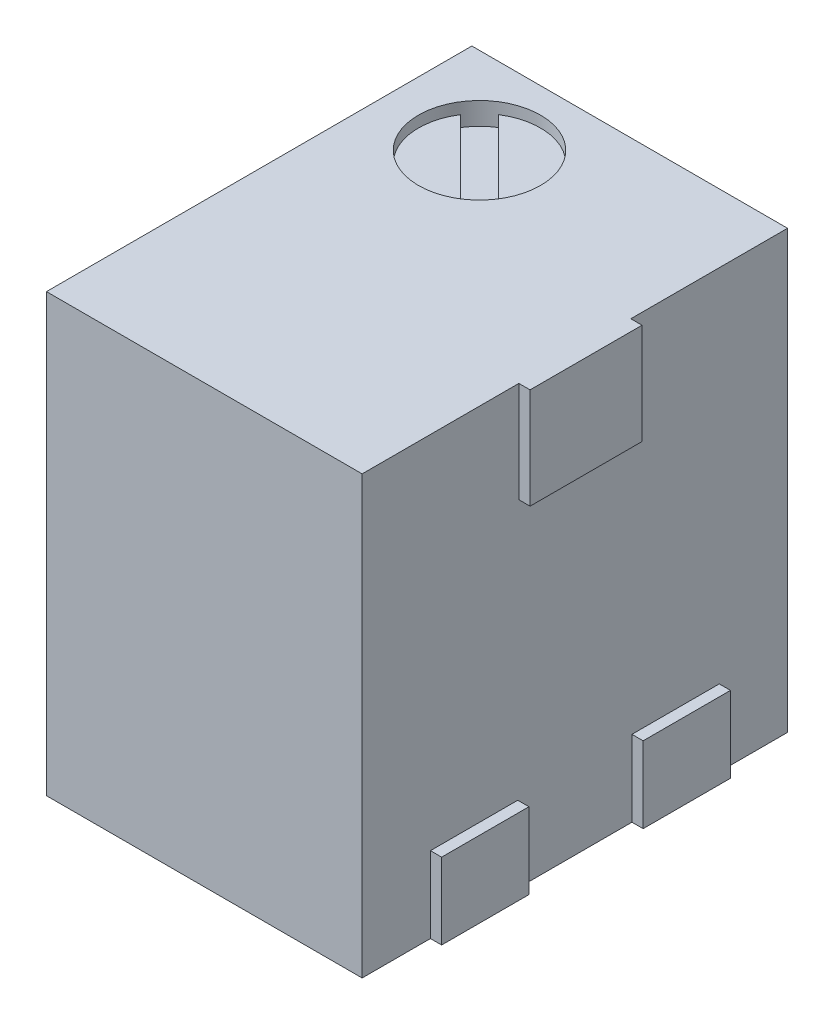
ISO-10303-21;
HEADER;
FILE_DESCRIPTION(('STEP AP214'),'2;1');
FILE_NAME('part.step','',(''),(''),'','','');
FILE_SCHEMA(('AUTOMOTIVE_DESIGN { 1 0 10303 214 1 1 1 1 }'));
ENDSEC;
DATA;
#1=APPLICATION_CONTEXT('core data for automotive mechanical design processes');
#2=APPLICATION_PROTOCOL_DEFINITION('international standard','automotive_design',2000,#1);
#3=PRODUCT_CONTEXT('',#1,'mechanical');
#4=PRODUCT('Part','Part','',(#3));
#5=PRODUCT_RELATED_PRODUCT_CATEGORY('part','',(#4));
#6=PRODUCT_DEFINITION_FORMATION('','',#4);
#7=PRODUCT_DEFINITION_CONTEXT('part definition',#1,'design');
#8=PRODUCT_DEFINITION('design','',#6,#7);
#9=PRODUCT_DEFINITION_SHAPE('','',#8);
#10=(LENGTH_UNIT() NAMED_UNIT(*) SI_UNIT(.MILLI.,.METRE.));
#11=(NAMED_UNIT(*) PLANE_ANGLE_UNIT() SI_UNIT($,.RADIAN.));
#12=(NAMED_UNIT(*) SI_UNIT($,.STERADIAN.) SOLID_ANGLE_UNIT());
#13=UNCERTAINTY_MEASURE_WITH_UNIT(LENGTH_MEASURE(1.E-05),#10,'distance_accuracy_value','');
#14=(GEOMETRIC_REPRESENTATION_CONTEXT(3) GLOBAL_UNCERTAINTY_ASSIGNED_CONTEXT((#13)) GLOBAL_UNIT_ASSIGNED_CONTEXT((#10,
#11,#12)) REPRESENTATION_CONTEXT('',''));
#15=CARTESIAN_POINT('',(0.,0.,0.));
#16=DIRECTION('',(0.,0.,1.));
#17=DIRECTION('',(1.,0.,0.));
#18=AXIS2_PLACEMENT_3D('',#15,#16,#17);
#19=CARTESIAN_POINT('',(32.6016,0.913499999999793,103.5585));
#20=DIRECTION('',(-1.,0.,0.));
#21=DIRECTION('',(0.,0.,1.));
#22=AXIS2_PLACEMENT_3D('',#19,#20,#21);
#23=PLANE('',#22);
#24=DIRECTION('',(0.,0.,1.));
#25=VECTOR('',#24,1.);
#26=CARTESIAN_POINT('',(32.6016,-1.56300000000021,103.5585));
#27=LINE('',#26,#25);
#28=CARTESIAN_POINT('',(32.6016,-1.56300000000021,101.1455));
#29=VERTEX_POINT('',#28);
#30=CARTESIAN_POINT('',(32.6016,-1.56300000000021,105.9715));
#31=VERTEX_POINT('',#30);
#32=EDGE_CURVE('E11',#29,#31,#27,.T.);
#33=ORIENTED_EDGE('',*,*,#32,.T.);
#34=DIRECTION('',(0.,1.,0.));
#35=VECTOR('',#34,1.);
#36=CARTESIAN_POINT('',(32.6016,0.913499999999793,105.9715));
#37=LINE('',#36,#35);
#38=CARTESIAN_POINT('',(32.6016,3.38999999999979,105.9715));
#39=VERTEX_POINT('',#38);
#40=EDGE_CURVE('E27',#31,#39,#37,.T.);
#41=ORIENTED_EDGE('',*,*,#40,.T.);
#42=DIRECTION('',(0.,0.,-1.));
#43=VECTOR('',#42,1.);
#44=CARTESIAN_POINT('',(32.6016,3.38999999999979,103.5585));
#45=LINE('',#44,#43);
#46=CARTESIAN_POINT('',(32.6016,3.38999999999979,101.1455));
#47=VERTEX_POINT('',#46);
#48=EDGE_CURVE('E244',#39,#47,#45,.T.);
#49=ORIENTED_EDGE('',*,*,#48,.T.);
#50=DIRECTION('',(0.,-1.,0.));
#51=VECTOR('',#50,1.);
#52=CARTESIAN_POINT('',(32.6016,0.913499999999797,101.1455));
#53=LINE('',#52,#51);
#54=EDGE_CURVE('E254',#47,#29,#53,.T.);
#55=ORIENTED_EDGE('',*,*,#54,.T.);
#56=EDGE_LOOP('',(#33,#41,#49,#55));
#57=FACE_BOUND('',#56,.T.);
#58=ADVANCED_FACE('F17',(#57),#23,.T.);
#59=CARTESIAN_POINT('',(36.31,3.38999999999979,105.9715));
#60=DIRECTION('',(0.,0.,1.));
#61=DIRECTION('',(0.,-1.,0.));
#62=AXIS2_PLACEMENT_3D('',#59,#60,#61);
#63=PLANE('',#62);
#64=DIRECTION('',(0.,1.,0.));
#65=VECTOR('',#64,1.);
#66=CARTESIAN_POINT('',(36.183,3.38999999999979,105.9715));
#67=LINE('',#66,#65);
#68=CARTESIAN_POINT('',(36.183,-1.56300000000021,105.9715));
#69=VERTEX_POINT('',#68);
#70=CARTESIAN_POINT('',(36.183,3.38999999999979,105.9715));
#71=VERTEX_POINT('',#70);
#72=EDGE_CURVE('E223',#69,#71,#67,.T.);
#73=ORIENTED_EDGE('',*,*,#72,.T.);
#74=DIRECTION('',(-1.,0.,0.));
#75=VECTOR('',#74,1.);
#76=CARTESIAN_POINT('',(36.31,3.38999999999979,105.9715));
#77=LINE('',#76,#75);
#78=EDGE_CURVE('E212',#71,#39,#77,.T.);
#79=ORIENTED_EDGE('',*,*,#78,.T.);
#80=ORIENTED_EDGE('',*,*,#40,.F.);
#81=DIRECTION('',(1.,0.,0.));
#82=VECTOR('',#81,1.);
#83=CARTESIAN_POINT('',(36.31,-1.56300000000021,105.9715));
#84=LINE('',#83,#82);
#85=EDGE_CURVE('E210',#31,#69,#84,.T.);
#86=ORIENTED_EDGE('',*,*,#85,.T.);
#87=EDGE_LOOP('',(#73,#79,#80,#86));
#88=FACE_BOUND('',#87,.T.);
#89=ADVANCED_FACE('F362',(#88),#63,.T.);
#90=CARTESIAN_POINT('',(36.31,-1.56300000000021,105.9715));
#91=DIRECTION('',(0.,-1.,0.));
#92=DIRECTION('',(0.,0.,-1.));
#93=AXIS2_PLACEMENT_3D('',#90,#91,#92);
#94=PLANE('',#93);
#95=DIRECTION('',(0.,0.,1.));
#96=VECTOR('',#95,1.);
#97=CARTESIAN_POINT('',(36.183,-1.56300000000021,105.9715));
#98=LINE('',#97,#96);
#99=CARTESIAN_POINT('',(36.183,-1.56300000000021,105.1968));
#100=VERTEX_POINT('',#99);
#101=EDGE_CURVE('E202',#100,#69,#98,.T.);
#102=ORIENTED_EDGE('',*,*,#101,.T.);
#103=ORIENTED_EDGE('',*,*,#85,.F.);
#104=ORIENTED_EDGE('',*,*,#32,.F.);
#105=DIRECTION('',(1.,0.,0.));
#106=VECTOR('',#105,1.);
#107=CARTESIAN_POINT('',(36.31,-1.56300000000021,101.1455));
#108=LINE('',#107,#106);
#109=CARTESIAN_POINT('',(36.183,-1.56300000000021,101.1455));
#110=VERTEX_POINT('',#109);
#111=EDGE_CURVE('E199',#29,#110,#108,.T.);
#112=ORIENTED_EDGE('',*,*,#111,.T.);
#113=DIRECTION('',(0.,0.,1.));
#114=VECTOR('',#113,1.);
#115=CARTESIAN_POINT('',(36.183,-1.56300000000021,105.9715));
#116=LINE('',#115,#114);
#117=CARTESIAN_POINT('',(36.183,-1.56300000000021,101.9202));
#118=VERTEX_POINT('',#117);
#119=EDGE_CURVE('E203',#110,#118,#116,.T.);
#120=ORIENTED_EDGE('',*,*,#119,.T.);
#121=DIRECTION('',(1.,0.,0.));
#122=VECTOR('',#121,1.);
#123=CARTESIAN_POINT('',(36.31,-1.56300000000021,101.9202));
#124=LINE('',#123,#122);
#125=CARTESIAN_POINT('',(36.31,-1.56300000000021,101.9202));
#126=VERTEX_POINT('',#125);
#127=EDGE_CURVE('E156',#118,#126,#124,.T.);
#128=ORIENTED_EDGE('',*,*,#127,.T.);
#129=DIRECTION('',(0.,0.,1.));
#130=VECTOR('',#129,1.);
#131=CARTESIAN_POINT('',(36.31,-1.56300000000021,105.9715));
#132=LINE('',#131,#130);
#133=CARTESIAN_POINT('',(36.31,-1.56300000000021,102.9108));
#134=VERTEX_POINT('',#133);
#135=EDGE_CURVE('E183',#126,#134,#132,.T.);
#136=ORIENTED_EDGE('',*,*,#135,.T.);
#137=DIRECTION('',(-1.,0.,0.));
#138=VECTOR('',#137,1.);
#139=CARTESIAN_POINT('',(36.31,-1.56300000000021,102.9108));
#140=LINE('',#139,#138);
#141=CARTESIAN_POINT('',(36.183,-1.56300000000021,102.9108));
#142=VERTEX_POINT('',#141);
#143=EDGE_CURVE('E180',#134,#142,#140,.T.);
#144=ORIENTED_EDGE('',*,*,#143,.T.);
#145=DIRECTION('',(0.,0.,1.));
#146=VECTOR('',#145,1.);
#147=CARTESIAN_POINT('',(36.183,-1.56300000000021,105.9715));
#148=LINE('',#147,#146);
#149=CARTESIAN_POINT('',(36.183,-1.56300000000021,104.2062));
#150=VERTEX_POINT('',#149);
#151=EDGE_CURVE('E178',#142,#150,#148,.T.);
#152=ORIENTED_EDGE('',*,*,#151,.T.);
#153=DIRECTION('',(1.,0.,0.));
#154=VECTOR('',#153,1.);
#155=CARTESIAN_POINT('',(36.31,-1.56300000000021,104.2062));
#156=LINE('',#155,#154);
#157=CARTESIAN_POINT('',(36.31,-1.56300000000021,104.2062));
#158=VERTEX_POINT('',#157);
#159=EDGE_CURVE('E175',#150,#158,#156,.T.);
#160=ORIENTED_EDGE('',*,*,#159,.T.);
#161=DIRECTION('',(0.,0.,1.));
#162=VECTOR('',#161,1.);
#163=CARTESIAN_POINT('',(36.31,-1.56300000000021,105.9715));
#164=LINE('',#163,#162);
#165=CARTESIAN_POINT('',(36.31,-1.56300000000021,105.1968));
#166=VERTEX_POINT('',#165);
#167=EDGE_CURVE('E179',#158,#166,#164,.T.);
#168=ORIENTED_EDGE('',*,*,#167,.T.);
#169=DIRECTION('',(-1.,0.,0.));
#170=VECTOR('',#169,1.);
#171=CARTESIAN_POINT('',(36.31,-1.56300000000021,105.1968));
#172=LINE('',#171,#170);
#173=EDGE_CURVE('E338',#166,#100,#172,.T.);
#174=ORIENTED_EDGE('',*,*,#173,.T.);
#175=EDGE_LOOP('',(#102,#103,#104,#112,#120,#128,#136,#144,#152,#160,#168,#174));
#176=FACE_BOUND('',#175,.T.);
#177=ADVANCED_FACE('F340',(#176),#94,.T.);
#178=CARTESIAN_POINT('',(36.31,-1.5630000000002,101.1455));
#179=DIRECTION('',(0.,0.,-1.));
#180=DIRECTION('',(-1.,0.,0.));
#181=AXIS2_PLACEMENT_3D('',#178,#179,#180);
#182=PLANE('',#181);
#183=DIRECTION('',(0.,-1.,0.));
#184=VECTOR('',#183,1.);
#185=CARTESIAN_POINT('',(36.183,-1.5630000000002,101.1455));
#186=LINE('',#185,#184);
#187=CARTESIAN_POINT('',(36.183,3.38999999999979,101.1455));
#188=VERTEX_POINT('',#187);
#189=EDGE_CURVE('E348',#188,#110,#186,.T.);
#190=ORIENTED_EDGE('',*,*,#189,.T.);
#191=ORIENTED_EDGE('',*,*,#111,.F.);
#192=ORIENTED_EDGE('',*,*,#54,.F.);
#193=DIRECTION('',(1.,0.,0.));
#194=VECTOR('',#193,1.);
#195=CARTESIAN_POINT('',(36.31,3.38999999999979,101.1455));
#196=LINE('',#195,#194);
#197=EDGE_CURVE('E165',#47,#188,#196,.T.);
#198=ORIENTED_EDGE('',*,*,#197,.T.);
#199=EDGE_LOOP('',(#190,#191,#192,#198));
#200=FACE_BOUND('',#199,.T.);
#201=ADVANCED_FACE('F357',(#200),#182,.T.);
#202=CARTESIAN_POINT('',(36.31,3.38999999999979,101.1455));
#203=DIRECTION('',(0.,1.,0.));
#204=DIRECTION('',(0.,0.,1.));
#205=AXIS2_PLACEMENT_3D('',#202,#203,#204);
#206=PLANE('',#205);
#207=CARTESIAN_POINT('',(33.6695990721049,3.38999999999979,102.126748828183));
#208=DIRECTION('',(0.,-1.,0.));
#209=DIRECTION('',(1.,0.,0.));
#210=AXIS2_PLACEMENT_3D('',#207,#208,#209);
#211=CIRCLE('',#210,0.692158872138563);
#212=CARTESIAN_POINT('',(34.3617579442435,3.38999999999979,102.126748828183));
#213=VERTEX_POINT('',#212);
#214=EDGE_CURVE('E173',#213,#213,#211,.T.);
#215=ORIENTED_EDGE('',*,*,#214,.T.);
#216=EDGE_LOOP('',(#215));
#217=FACE_BOUND('',#216,.T.);
#218=DIRECTION('',(0.,0.,-1.));
#219=VECTOR('',#218,1.);
#220=CARTESIAN_POINT('',(36.183,3.38999999999979,101.1455));
#221=LINE('',#220,#219);
#222=CARTESIAN_POINT('',(36.183,3.38999999999979,104.1935));
#223=VERTEX_POINT('',#222);
#224=EDGE_CURVE('E170',#71,#223,#221,.T.);
#225=ORIENTED_EDGE('',*,*,#224,.T.);
#226=DIRECTION('',(1.,0.,0.));
#227=VECTOR('',#226,1.);
#228=CARTESIAN_POINT('',(36.31,3.38999999999979,104.1935));
#229=LINE('',#228,#227);
#230=CARTESIAN_POINT('',(36.31,3.38999999999979,104.1935));
#231=VERTEX_POINT('',#230);
#232=EDGE_CURVE('E174',#223,#231,#229,.T.);
#233=ORIENTED_EDGE('',*,*,#232,.T.);
#234=DIRECTION('',(0.,0.,-1.));
#235=VECTOR('',#234,1.);
#236=CARTESIAN_POINT('',(36.31,3.38999999999979,101.1455));
#237=LINE('',#236,#235);
#238=CARTESIAN_POINT('',(36.31,3.38999999999979,102.9235));
#239=VERTEX_POINT('',#238);
#240=EDGE_CURVE('E217',#231,#239,#237,.T.);
#241=ORIENTED_EDGE('',*,*,#240,.T.);
#242=DIRECTION('',(-1.,0.,0.));
#243=VECTOR('',#242,1.);
#244=CARTESIAN_POINT('',(36.31,3.38999999999979,102.9235));
#245=LINE('',#244,#243);
#246=CARTESIAN_POINT('',(36.183,3.38999999999979,102.9235));
#247=VERTEX_POINT('',#246);
#248=EDGE_CURVE('E220',#239,#247,#245,.T.);
#249=ORIENTED_EDGE('',*,*,#248,.T.);
#250=DIRECTION('',(0.,0.,-1.));
#251=VECTOR('',#250,1.);
#252=CARTESIAN_POINT('',(36.183,3.38999999999979,101.1455));
#253=LINE('',#252,#251);
#254=EDGE_CURVE('E225',#247,#188,#253,.T.);
#255=ORIENTED_EDGE('',*,*,#254,.T.);
#256=ORIENTED_EDGE('',*,*,#197,.F.);
#257=ORIENTED_EDGE('',*,*,#48,.F.);
#258=ORIENTED_EDGE('',*,*,#78,.F.);
#259=EDGE_LOOP('',(#225,#233,#241,#249,#255,#256,#257,#258));
#260=FACE_BOUND('',#259,.T.);
#261=ADVANCED_FACE('F358',(#217,#260),#206,.T.);
#262=CARTESIAN_POINT('',(36.183,0.680918984547255,103.5585));
#263=DIRECTION('',(1.,0.,0.));
#264=DIRECTION('',(0.,0.,-1.));
#265=AXIS2_PLACEMENT_3D('',#262,#263,#264);
#266=PLANE('',#265);
#267=ORIENTED_EDGE('',*,*,#189,.F.);
#268=ORIENTED_EDGE('',*,*,#254,.F.);
#269=DIRECTION('',(0.,-1.,0.));
#270=VECTOR('',#269,1.);
#271=CARTESIAN_POINT('',(36.183,0.680918984547255,102.9235));
#272=LINE('',#271,#270);
#273=CARTESIAN_POINT('',(36.183,2.24699999999979,102.9235));
#274=VERTEX_POINT('',#273);
#275=EDGE_CURVE('E228',#247,#274,#272,.T.);
#276=ORIENTED_EDGE('',*,*,#275,.T.);
#277=DIRECTION('',(0.,0.,1.));
#278=VECTOR('',#277,1.);
#279=CARTESIAN_POINT('',(36.183,2.24699999999979,103.5585));
#280=LINE('',#279,#278);
#281=CARTESIAN_POINT('',(36.183,2.24699999999979,104.1935));
#282=VERTEX_POINT('',#281);
#283=EDGE_CURVE('E187',#274,#282,#280,.T.);
#284=ORIENTED_EDGE('',*,*,#283,.T.);
#285=DIRECTION('',(0.,1.,0.));
#286=VECTOR('',#285,1.);
#287=CARTESIAN_POINT('',(36.183,0.680918984547255,104.1935));
#288=LINE('',#287,#286);
#289=EDGE_CURVE('E184',#282,#223,#288,.T.);
#290=ORIENTED_EDGE('',*,*,#289,.T.);
#291=ORIENTED_EDGE('',*,*,#224,.F.);
#292=ORIENTED_EDGE('',*,*,#72,.F.);
#293=ORIENTED_EDGE('',*,*,#101,.F.);
#294=DIRECTION('',(0.,1.,0.));
#295=VECTOR('',#294,1.);
#296=CARTESIAN_POINT('',(36.183,0.680918984547255,105.1968));
#297=LINE('',#296,#295);
#298=CARTESIAN_POINT('',(36.183,-0.699400000000207,105.1968));
#299=VERTEX_POINT('',#298);
#300=EDGE_CURVE('E188',#100,#299,#297,.T.);
#301=ORIENTED_EDGE('',*,*,#300,.T.);
#302=DIRECTION('',(0.,0.,-1.));
#303=VECTOR('',#302,1.);
#304=CARTESIAN_POINT('',(36.183,-0.699400000000207,103.5585));
#305=LINE('',#304,#303);
#306=CARTESIAN_POINT('',(36.183,-0.699400000000207,104.2062));
#307=VERTEX_POINT('',#306);
#308=EDGE_CURVE('E236',#299,#307,#305,.T.);
#309=ORIENTED_EDGE('',*,*,#308,.T.);
#310=DIRECTION('',(0.,-1.,0.));
#311=VECTOR('',#310,1.);
#312=CARTESIAN_POINT('',(36.183,0.680918984547255,104.2062));
#313=LINE('',#312,#311);
#314=EDGE_CURVE('E267',#307,#150,#313,.T.);
#315=ORIENTED_EDGE('',*,*,#314,.T.);
#316=ORIENTED_EDGE('',*,*,#151,.F.);
#317=DIRECTION('',(0.,1.,0.));
#318=VECTOR('',#317,1.);
#319=CARTESIAN_POINT('',(36.183,0.680918984547255,102.9108));
#320=LINE('',#319,#318);
#321=CARTESIAN_POINT('',(36.183,-0.699400000000207,102.9108));
#322=VERTEX_POINT('',#321);
#323=EDGE_CURVE('E151',#142,#322,#320,.T.);
#324=ORIENTED_EDGE('',*,*,#323,.T.);
#325=DIRECTION('',(0.,0.,-1.));
#326=VECTOR('',#325,1.);
#327=CARTESIAN_POINT('',(36.183,-0.699400000000207,103.5585));
#328=LINE('',#327,#326);
#329=CARTESIAN_POINT('',(36.183,-0.699400000000207,101.9202));
#330=VERTEX_POINT('',#329);
#331=EDGE_CURVE('E133',#322,#330,#328,.T.);
#332=ORIENTED_EDGE('',*,*,#331,.T.);
#333=DIRECTION('',(0.,-1.,0.));
#334=VECTOR('',#333,1.);
#335=CARTESIAN_POINT('',(36.183,0.680918984547258,101.9202));
#336=LINE('',#335,#334);
#337=EDGE_CURVE('E149',#330,#118,#336,.T.);
#338=ORIENTED_EDGE('',*,*,#337,.T.);
#339=ORIENTED_EDGE('',*,*,#119,.F.);
#340=EDGE_LOOP('',(#267,#268,#276,#284,#290,#291,#292,#293,#301,#309,#315,#316,#324,#332,#338,#339));
#341=FACE_BOUND('',#340,.T.);
#342=ADVANCED_FACE('F147',(#341),#266,.T.);
#343=CARTESIAN_POINT('',(36.31,-1.56300000000021,105.1968));
#344=DIRECTION('',(0.,0.,1.));
#345=DIRECTION('',(0.,-1.,0.));
#346=AXIS2_PLACEMENT_3D('',#343,#344,#345);
#347=PLANE('',#346);
#348=ORIENTED_EDGE('',*,*,#300,.F.);
#349=ORIENTED_EDGE('',*,*,#173,.F.);
#350=DIRECTION('',(0.,1.,0.));
#351=VECTOR('',#350,1.);
#352=CARTESIAN_POINT('',(36.31,-1.56300000000021,105.1968));
#353=LINE('',#352,#351);
#354=CARTESIAN_POINT('',(36.31,-0.699400000000207,105.1968));
#355=VERTEX_POINT('',#354);
#356=EDGE_CURVE('E158',#166,#355,#353,.T.);
#357=ORIENTED_EDGE('',*,*,#356,.T.);
#358=DIRECTION('',(-1.,0.,0.));
#359=VECTOR('',#358,1.);
#360=CARTESIAN_POINT('',(36.31,-0.699400000000207,105.1968));
#361=LINE('',#360,#359);
#362=EDGE_CURVE('E161',#355,#299,#361,.T.);
#363=ORIENTED_EDGE('',*,*,#362,.T.);
#364=EDGE_LOOP('',(#348,#349,#357,#363));
#365=FACE_BOUND('',#364,.T.);
#366=ADVANCED_FACE('F407',(#365),#347,.T.);
#367=CARTESIAN_POINT('',(36.31,0.913499999999793,103.5585));
#368=DIRECTION('',(1.,0.,0.));
#369=DIRECTION('',(0.,0.,-1.));
#370=AXIS2_PLACEMENT_3D('',#367,#368,#369);
#371=PLANE('',#370);
#372=DIRECTION('',(0.,1.,0.));
#373=VECTOR('',#372,1.);
#374=CARTESIAN_POINT('',(36.31,0.913499999999793,104.2062));
#375=LINE('',#374,#373);
#376=CARTESIAN_POINT('',(36.31,-0.699400000000207,104.2062));
#377=VERTEX_POINT('',#376);
#378=EDGE_CURVE('E169',#158,#377,#375,.T.);
#379=ORIENTED_EDGE('',*,*,#378,.T.);
#380=DIRECTION('',(0.,0.,1.));
#381=VECTOR('',#380,1.);
#382=CARTESIAN_POINT('',(36.31,-0.699400000000207,103.5585));
#383=LINE('',#382,#381);
#384=EDGE_CURVE('E280',#377,#355,#383,.T.);
#385=ORIENTED_EDGE('',*,*,#384,.T.);
#386=ORIENTED_EDGE('',*,*,#356,.F.);
#387=ORIENTED_EDGE('',*,*,#167,.F.);
#388=EDGE_LOOP('',(#379,#385,#386,#387));
#389=FACE_BOUND('',#388,.T.);
#390=ADVANCED_FACE('F335',(#389),#371,.T.);
#391=CARTESIAN_POINT('',(36.31,-0.699400000000207,104.2062));
#392=DIRECTION('',(0.,0.,-1.));
#393=DIRECTION('',(-1.,0.,0.));
#394=AXIS2_PLACEMENT_3D('',#391,#392,#393);
#395=PLANE('',#394);
#396=ORIENTED_EDGE('',*,*,#314,.F.);
#397=DIRECTION('',(1.,0.,0.));
#398=VECTOR('',#397,1.);
#399=CARTESIAN_POINT('',(36.31,-0.699400000000207,104.2062));
#400=LINE('',#399,#398);
#401=EDGE_CURVE('E216',#307,#377,#400,.T.);
#402=ORIENTED_EDGE('',*,*,#401,.T.);
#403=ORIENTED_EDGE('',*,*,#378,.F.);
#404=ORIENTED_EDGE('',*,*,#159,.F.);
#405=EDGE_LOOP('',(#396,#402,#403,#404));
#406=FACE_BOUND('',#405,.T.);
#407=ADVANCED_FACE('F325',(#406),#395,.T.);
#408=CARTESIAN_POINT('',(36.31,-1.56300000000021,102.9108));
#409=DIRECTION('',(0.,0.,1.));
#410=DIRECTION('',(0.,-1.,0.));
#411=AXIS2_PLACEMENT_3D('',#408,#409,#410);
#412=PLANE('',#411);
#413=ORIENTED_EDGE('',*,*,#323,.F.);
#414=ORIENTED_EDGE('',*,*,#143,.F.);
#415=DIRECTION('',(0.,1.,0.));
#416=VECTOR('',#415,1.);
#417=CARTESIAN_POINT('',(36.31,-1.56300000000021,102.9108));
#418=LINE('',#417,#416);
#419=CARTESIAN_POINT('',(36.31,-0.699400000000207,102.9108));
#420=VERTEX_POINT('',#419);
#421=EDGE_CURVE('E213',#134,#420,#418,.T.);
#422=ORIENTED_EDGE('',*,*,#421,.T.);
#423=DIRECTION('',(-1.,0.,0.));
#424=VECTOR('',#423,1.);
#425=CARTESIAN_POINT('',(36.31,-0.699400000000207,102.9108));
#426=LINE('',#425,#424);
#427=EDGE_CURVE('E206',#420,#322,#426,.T.);
#428=ORIENTED_EDGE('',*,*,#427,.T.);
#429=EDGE_LOOP('',(#413,#414,#422,#428));
#430=FACE_BOUND('',#429,.T.);
#431=ADVANCED_FACE('F343',(#430),#412,.T.);
#432=CARTESIAN_POINT('',(36.31,0.913499999999793,103.5585));
#433=DIRECTION('',(1.,0.,0.));
#434=DIRECTION('',(0.,0.,-1.));
#435=AXIS2_PLACEMENT_3D('',#432,#433,#434);
#436=PLANE('',#435);
#437=DIRECTION('',(0.,1.,0.));
#438=VECTOR('',#437,1.);
#439=CARTESIAN_POINT('',(36.31,0.913499999999797,101.9202));
#440=LINE('',#439,#438);
#441=CARTESIAN_POINT('',(36.31,-0.699400000000207,101.9202));
#442=VERTEX_POINT('',#441);
#443=EDGE_CURVE('E204',#126,#442,#440,.T.);
#444=ORIENTED_EDGE('',*,*,#443,.T.);
#445=DIRECTION('',(0.,0.,1.));
#446=VECTOR('',#445,1.);
#447=CARTESIAN_POINT('',(36.31,-0.699400000000207,103.5585));
#448=LINE('',#447,#446);
#449=EDGE_CURVE('E136',#442,#420,#448,.T.);
#450=ORIENTED_EDGE('',*,*,#449,.T.);
#451=ORIENTED_EDGE('',*,*,#421,.F.);
#452=ORIENTED_EDGE('',*,*,#135,.F.);
#453=EDGE_LOOP('',(#444,#450,#451,#452));
#454=FACE_BOUND('',#453,.T.);
#455=ADVANCED_FACE('F352',(#454),#436,.T.);
#456=CARTESIAN_POINT('',(36.31,-0.699400000000207,101.9202));
#457=DIRECTION('',(0.,0.,-1.));
#458=DIRECTION('',(-1.,0.,0.));
#459=AXIS2_PLACEMENT_3D('',#456,#457,#458);
#460=PLANE('',#459);
#461=ORIENTED_EDGE('',*,*,#337,.F.);
#462=DIRECTION('',(1.,0.,0.));
#463=VECTOR('',#462,1.);
#464=CARTESIAN_POINT('',(36.31,-0.699400000000207,101.9202));
#465=LINE('',#464,#463);
#466=EDGE_CURVE('E129',#330,#442,#465,.T.);
#467=ORIENTED_EDGE('',*,*,#466,.T.);
#468=ORIENTED_EDGE('',*,*,#443,.F.);
#469=ORIENTED_EDGE('',*,*,#127,.F.);
#470=EDGE_LOOP('',(#461,#467,#468,#469));
#471=FACE_BOUND('',#470,.T.);
#472=ADVANCED_FACE('F154',(#471),#460,.T.);
#473=CARTESIAN_POINT('',(36.31,3.38999999999979,104.1935));
#474=DIRECTION('',(0.,0.,1.));
#475=DIRECTION('',(0.,-1.,0.));
#476=AXIS2_PLACEMENT_3D('',#473,#474,#475);
#477=PLANE('',#476);
#478=ORIENTED_EDGE('',*,*,#289,.F.);
#479=DIRECTION('',(1.,0.,0.));
#480=VECTOR('',#479,1.);
#481=CARTESIAN_POINT('',(36.31,2.24699999999979,104.1935));
#482=LINE('',#481,#480);
#483=CARTESIAN_POINT('',(36.31,2.24699999999979,104.1935));
#484=VERTEX_POINT('',#483);
#485=EDGE_CURVE('E141',#282,#484,#482,.T.);
#486=ORIENTED_EDGE('',*,*,#485,.T.);
#487=DIRECTION('',(0.,1.,0.));
#488=VECTOR('',#487,1.);
#489=CARTESIAN_POINT('',(36.31,3.38999999999979,104.1935));
#490=LINE('',#489,#488);
#491=EDGE_CURVE('E246',#484,#231,#490,.T.);
#492=ORIENTED_EDGE('',*,*,#491,.T.);
#493=ORIENTED_EDGE('',*,*,#232,.F.);
#494=EDGE_LOOP('',(#478,#486,#492,#493));
#495=FACE_BOUND('',#494,.T.);
#496=ADVANCED_FACE('F370',(#495),#477,.T.);
#497=CARTESIAN_POINT('',(36.31,2.24699999999979,102.9235));
#498=DIRECTION('',(0.,0.,-1.));
#499=DIRECTION('',(-1.,0.,0.));
#500=AXIS2_PLACEMENT_3D('',#497,#498,#499);
#501=PLANE('',#500);
#502=ORIENTED_EDGE('',*,*,#275,.F.);
#503=ORIENTED_EDGE('',*,*,#248,.F.);
#504=DIRECTION('',(0.,-1.,0.));
#505=VECTOR('',#504,1.);
#506=CARTESIAN_POINT('',(36.31,2.24699999999979,102.9235));
#507=LINE('',#506,#505);
#508=CARTESIAN_POINT('',(36.31,2.24699999999979,102.9235));
#509=VERTEX_POINT('',#508);
#510=EDGE_CURVE('E248',#239,#509,#507,.T.);
#511=ORIENTED_EDGE('',*,*,#510,.T.);
#512=DIRECTION('',(-1.,0.,0.));
#513=VECTOR('',#512,1.);
#514=CARTESIAN_POINT('',(36.31,2.24699999999979,102.9235));
#515=LINE('',#514,#513);
#516=EDGE_CURVE('E209',#509,#274,#515,.T.);
#517=ORIENTED_EDGE('',*,*,#516,.T.);
#518=EDGE_LOOP('',(#502,#503,#511,#517));
#519=FACE_BOUND('',#518,.T.);
#520=ADVANCED_FACE('F379',(#519),#501,.T.);
#521=CARTESIAN_POINT('',(36.31,0.913499999999793,103.5585));
#522=DIRECTION('',(1.,0.,0.));
#523=DIRECTION('',(0.,0.,-1.));
#524=AXIS2_PLACEMENT_3D('',#521,#522,#523);
#525=PLANE('',#524);
#526=ORIENTED_EDGE('',*,*,#510,.F.);
#527=ORIENTED_EDGE('',*,*,#240,.F.);
#528=ORIENTED_EDGE('',*,*,#491,.F.);
#529=DIRECTION('',(0.,0.,-1.));
#530=VECTOR('',#529,1.);
#531=CARTESIAN_POINT('',(36.31,2.24699999999979,103.5585));
#532=LINE('',#531,#530);
#533=EDGE_CURVE('E192',#484,#509,#532,.T.);
#534=ORIENTED_EDGE('',*,*,#533,.T.);
#535=EDGE_LOOP('',(#526,#527,#528,#534));
#536=FACE_BOUND('',#535,.T.);
#537=ADVANCED_FACE('F381',(#536),#525,.T.);
#538=CARTESIAN_POINT('',(36.31,-0.699400000000207,102.9108));
#539=DIRECTION('',(0.,1.,0.));
#540=DIRECTION('',(0.,0.,1.));
#541=AXIS2_PLACEMENT_3D('',#538,#539,#540);
#542=PLANE('',#541);
#543=ORIENTED_EDGE('',*,*,#331,.F.);
#544=ORIENTED_EDGE('',*,*,#427,.F.);
#545=ORIENTED_EDGE('',*,*,#449,.F.);
#546=ORIENTED_EDGE('',*,*,#466,.F.);
#547=EDGE_LOOP('',(#543,#544,#545,#546));
#548=FACE_BOUND('',#547,.T.);
#549=ADVANCED_FACE('F131',(#548),#542,.T.);
#550=CARTESIAN_POINT('',(36.31,-0.699400000000207,105.1968));
#551=DIRECTION('',(0.,1.,0.));
#552=DIRECTION('',(0.,0.,1.));
#553=AXIS2_PLACEMENT_3D('',#550,#551,#552);
#554=PLANE('',#553);
#555=ORIENTED_EDGE('',*,*,#308,.F.);
#556=ORIENTED_EDGE('',*,*,#362,.F.);
#557=ORIENTED_EDGE('',*,*,#384,.F.);
#558=ORIENTED_EDGE('',*,*,#401,.F.);
#559=EDGE_LOOP('',(#555,#556,#557,#558));
#560=FACE_BOUND('',#559,.T.);
#561=ADVANCED_FACE('F331',(#560),#554,.T.);
#562=CARTESIAN_POINT('',(36.31,2.24699999999979,104.1935));
#563=DIRECTION('',(0.,-1.,0.));
#564=DIRECTION('',(0.,0.,-1.));
#565=AXIS2_PLACEMENT_3D('',#562,#563,#564);
#566=PLANE('',#565);
#567=ORIENTED_EDGE('',*,*,#283,.F.);
#568=ORIENTED_EDGE('',*,*,#516,.F.);
#569=ORIENTED_EDGE('',*,*,#533,.F.);
#570=ORIENTED_EDGE('',*,*,#485,.F.);
#571=EDGE_LOOP('',(#567,#568,#569,#570));
#572=FACE_BOUND('',#571,.T.);
#573=ADVANCED_FACE('F376',(#572),#566,.T.);
#574=CARTESIAN_POINT('',(33.6695990721049,3.26299999999979,102.126748828183));
#575=DIRECTION('',(0.,1.,0.));
#576=DIRECTION('',(0.,0.,1.));
#577=AXIS2_PLACEMENT_3D('',#574,#575,#576);
#578=PLANE('',#577);
#579=DIRECTION('',(-0.705108528470342,0.,-0.70909940281909));
#580=VECTOR('',#579,1.);
#581=CARTESIAN_POINT('',(34.0376023361259,3.26299999999979,102.712971910251));
#582=LINE('',#581,#580);
#583=CARTESIAN_POINT('',(34.0376023361259,3.26299999999979,102.712971910251));
#584=VERTEX_POINT('',#583);
#585=CARTESIAN_POINT('',(33.0854623101046,3.26299999999979,101.755442825592));
#586=VERTEX_POINT('',#585);
#587=EDGE_CURVE('E189',#584,#586,#582,.T.);
#588=ORIENTED_EDGE('',*,*,#587,.T.);
#589=CARTESIAN_POINT('',(33.6695990721049,3.26299999999979,102.126748828183));
#590=DIRECTION('',(0.,1.,0.));
#591=DIRECTION('',(1.,0.,0.));
#592=AXIS2_PLACEMENT_3D('',#589,#590,#591);
#593=CIRCLE('',#592,0.692158872138563);
#594=EDGE_CURVE('E193',#586,#584,#593,.T.);
#595=ORIENTED_EDGE('',*,*,#594,.T.);
#596=EDGE_LOOP('',(#588,#595));
#597=FACE_BOUND('',#596,.T.);
#598=ADVANCED_FACE('F462',(#597),#578,.T.);
#599=CARTESIAN_POINT('',(33.6695990721049,3.26299999999979,102.126748828183));
#600=DIRECTION('',(0.,1.,0.));
#601=DIRECTION('',(0.,0.,1.));
#602=AXIS2_PLACEMENT_3D('',#599,#600,#601);
#603=PLANE('',#602);
#604=DIRECTION('',(0.705108528470342,0.,0.70909940281909));
#605=VECTOR('',#604,1.);
#606=CARTESIAN_POINT('',(33.3015958080839,3.26299999999979,101.540525746114));
#607=LINE('',#606,#605);
#608=CARTESIAN_POINT('',(33.3015958080839,3.26299999999979,101.540525746114));
#609=VERTEX_POINT('',#608);
#610=CARTESIAN_POINT('',(34.2537358341051,3.26299999999979,102.498054830774));
#611=VERTEX_POINT('',#610);
#612=EDGE_CURVE('E259',#609,#611,#607,.T.);
#613=ORIENTED_EDGE('',*,*,#612,.T.);
#614=CARTESIAN_POINT('',(33.6695990721049,3.26299999999979,102.126748828183));
#615=DIRECTION('',(0.,1.,0.));
#616=DIRECTION('',(1.,0.,0.));
#617=AXIS2_PLACEMENT_3D('',#614,#615,#616);
#618=CIRCLE('',#617,0.692158872138563);
#619=EDGE_CURVE('E257',#611,#609,#618,.T.);
#620=ORIENTED_EDGE('',*,*,#619,.T.);
#621=EDGE_LOOP('',(#613,#620));
#622=FACE_BOUND('',#621,.T.);
#623=ADVANCED_FACE('F471',(#622),#603,.T.);
#624=CARTESIAN_POINT('',(33.0854623101046,3.13599999999979,101.755442825592));
#625=DIRECTION('',(0.70909940281909,0.,-0.705108528470342));
#626=DIRECTION('',(-0.705108528470342,0.,-0.70909940281909));
#627=AXIS2_PLACEMENT_3D('',#624,#625,#626);
#628=PLANE('',#627);
#629=DIRECTION('',(0.,1.,0.));
#630=VECTOR('',#629,1.);
#631=CARTESIAN_POINT('',(34.0376023361259,3.13599999999979,102.712971910251));
#632=LINE('',#631,#630);
#633=CARTESIAN_POINT('',(34.0376023361259,3.13599999999979,102.712971910251));
#634=VERTEX_POINT('',#633);
#635=EDGE_CURVE('E198',#634,#584,#632,.T.);
#636=ORIENTED_EDGE('',*,*,#635,.F.);
#637=DIRECTION('',(0.705108528470342,0.,0.70909940281909));
#638=VECTOR('',#637,1.);
#639=CARTESIAN_POINT('',(33.0854623101046,3.13599999999979,101.755442825592));
#640=LINE('',#639,#638);
#641=CARTESIAN_POINT('',(33.0854623101046,3.13599999999979,101.755442825592));
#642=VERTEX_POINT('',#641);
#643=EDGE_CURVE('E197',#642,#634,#640,.T.);
#644=ORIENTED_EDGE('',*,*,#643,.F.);
#645=DIRECTION('',(0.,-1.,0.));
#646=VECTOR('',#645,1.);
#647=CARTESIAN_POINT('',(33.0854623101046,3.13599999999979,101.755442825592));
#648=LINE('',#647,#646);
#649=EDGE_CURVE('E21',#586,#642,#648,.T.);
#650=ORIENTED_EDGE('',*,*,#649,.F.);
#651=ORIENTED_EDGE('',*,*,#587,.F.);
#652=EDGE_LOOP('',(#636,#644,#650,#651));
#653=FACE_BOUND('',#652,.T.);
#654=ADVANCED_FACE('F312',(#653),#628,.T.);
#655=CARTESIAN_POINT('',(33.3015958080839,3.13599999999979,101.540525746114));
#656=DIRECTION('',(-0.70909940281909,0.,0.705108528470342));
#657=DIRECTION('',(0.705108528470342,0.,0.70909940281909));
#658=AXIS2_PLACEMENT_3D('',#655,#656,#657);
#659=PLANE('',#658);
#660=DIRECTION('',(0.,1.,0.));
#661=VECTOR('',#660,1.);
#662=CARTESIAN_POINT('',(33.3015958080839,3.13599999999979,101.540525746114));
#663=LINE('',#662,#661);
#664=CARTESIAN_POINT('',(33.3015958080839,3.13599999999979,101.540525746114));
#665=VERTEX_POINT('',#664);
#666=EDGE_CURVE('E285',#665,#609,#663,.T.);
#667=ORIENTED_EDGE('',*,*,#666,.F.);
#668=DIRECTION('',(-0.705108528470342,0.,-0.70909940281909));
#669=VECTOR('',#668,1.);
#670=CARTESIAN_POINT('',(33.3015958080839,3.13599999999979,101.540525746114));
#671=LINE('',#670,#669);
#672=CARTESIAN_POINT('',(34.2537358341051,3.13599999999979,102.498054830774));
#673=VERTEX_POINT('',#672);
#674=EDGE_CURVE('E243',#673,#665,#671,.T.);
#675=ORIENTED_EDGE('',*,*,#674,.F.);
#676=DIRECTION('',(0.,-1.,0.));
#677=VECTOR('',#676,1.);
#678=CARTESIAN_POINT('',(34.2537358341051,3.13599999999979,102.498054830774));
#679=LINE('',#678,#677);
#680=EDGE_CURVE('E194',#611,#673,#679,.T.);
#681=ORIENTED_EDGE('',*,*,#680,.F.);
#682=ORIENTED_EDGE('',*,*,#612,.F.);
#683=EDGE_LOOP('',(#667,#675,#681,#682));
#684=FACE_BOUND('',#683,.T.);
#685=ADVANCED_FACE('F305',(#684),#659,.T.);
#686=CARTESIAN_POINT('',(33.6695990721049,3.13599999999979,102.126748828183));
#687=DIRECTION('',(0.,1.,0.));
#688=DIRECTION('',(0.,0.,1.));
#689=AXIS2_PLACEMENT_3D('',#686,#687,#688);
#690=PLANE('',#689);
#691=CARTESIAN_POINT('',(33.6695990721049,3.13599999999979,102.126748828183));
#692=DIRECTION('',(0.,1.,0.));
#693=DIRECTION('',(1.,0.,0.));
#694=AXIS2_PLACEMENT_3D('',#691,#692,#693);
#695=CIRCLE('',#694,0.692158872138563);
#696=EDGE_CURVE('E260',#634,#673,#695,.T.);
#697=ORIENTED_EDGE('',*,*,#696,.T.);
#698=ORIENTED_EDGE('',*,*,#674,.T.);
#699=CARTESIAN_POINT('',(33.6695990721049,3.13599999999979,102.126748828183));
#700=DIRECTION('',(0.,1.,0.));
#701=DIRECTION('',(1.,0.,0.));
#702=AXIS2_PLACEMENT_3D('',#699,#700,#701);
#703=CIRCLE('',#702,0.692158872138563);
#704=EDGE_CURVE('E240',#665,#642,#703,.T.);
#705=ORIENTED_EDGE('',*,*,#704,.T.);
#706=ORIENTED_EDGE('',*,*,#643,.T.);
#707=EDGE_LOOP('',(#697,#698,#705,#706));
#708=FACE_BOUND('',#707,.T.);
#709=ADVANCED_FACE('F298',(#708),#690,.T.);
#710=CARTESIAN_POINT('',(33.6695990721049,3.26299999999979,102.126748828183));
#711=DIRECTION('',(0.,-1.,0.));
#712=DIRECTION('',(0.,0.,-1.));
#713=AXIS2_PLACEMENT_3D('',#710,#711,#712);
#714=CYLINDRICAL_SURFACE('',#713,0.692158872138563);
#715=ORIENTED_EDGE('',*,*,#214,.F.);
#716=EDGE_LOOP('',(#715));
#717=FACE_BOUND('',#716,.T.);
#718=ORIENTED_EDGE('',*,*,#594,.F.);
#719=ORIENTED_EDGE('',*,*,#649,.T.);
#720=ORIENTED_EDGE('',*,*,#704,.F.);
#721=ORIENTED_EDGE('',*,*,#666,.T.);
#722=ORIENTED_EDGE('',*,*,#619,.F.);
#723=ORIENTED_EDGE('',*,*,#680,.T.);
#724=ORIENTED_EDGE('',*,*,#696,.F.);
#725=ORIENTED_EDGE('',*,*,#635,.T.);
#726=EDGE_LOOP('',(#718,#719,#720,#721,#722,#723,#724,#725));
#727=FACE_BOUND('',#726,.T.);
#728=ADVANCED_FACE('F19',(#717,#727),#714,.F.);
#729=CLOSED_SHELL('',(#58,#89,#177,#201,#261,#342,#366,#390,#407,#431,#455,#472,#496,#520,#537,
#549,#561,#573,#598,#623,#654,#685,#709,#728));
#730=MANIFOLD_SOLID_BREP('B1',#729);
#731=ADVANCED_BREP_SHAPE_REPRESENTATION('',(#18,#730),#14);
#732=SHAPE_DEFINITION_REPRESENTATION(#9,#731);
ENDSEC;
END-ISO-10303-21;
